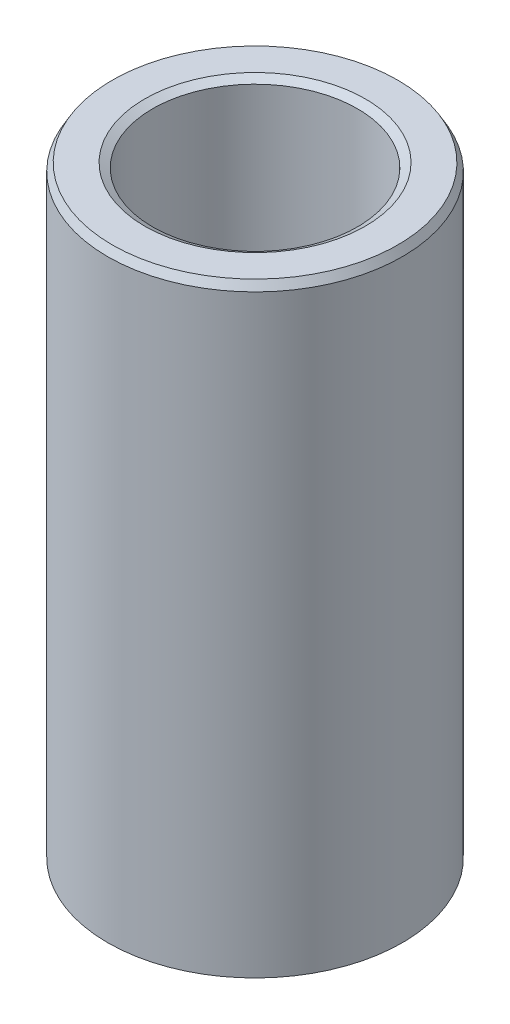
ISO-10303-21;
HEADER;
FILE_DESCRIPTION(('STEP AP214'),'2;1');
FILE_NAME('part.step','',(''),(''),'','','');
FILE_SCHEMA(('AUTOMOTIVE_DESIGN { 1 0 10303 214 1 1 1 1 }'));
ENDSEC;
DATA;
#1=APPLICATION_CONTEXT('core data for automotive mechanical design processes');
#2=APPLICATION_PROTOCOL_DEFINITION('international standard','automotive_design',2000,#1);
#3=PRODUCT_CONTEXT('',#1,'mechanical');
#4=PRODUCT('Part','Part','',(#3));
#5=PRODUCT_RELATED_PRODUCT_CATEGORY('part','',(#4));
#6=PRODUCT_DEFINITION_FORMATION('','',#4);
#7=PRODUCT_DEFINITION_CONTEXT('part definition',#1,'design');
#8=PRODUCT_DEFINITION('design','',#6,#7);
#9=PRODUCT_DEFINITION_SHAPE('','',#8);
#10=(LENGTH_UNIT() NAMED_UNIT(*) SI_UNIT(.MILLI.,.METRE.));
#11=(NAMED_UNIT(*) PLANE_ANGLE_UNIT() SI_UNIT($,.RADIAN.));
#12=(NAMED_UNIT(*) SI_UNIT($,.STERADIAN.) SOLID_ANGLE_UNIT());
#13=UNCERTAINTY_MEASURE_WITH_UNIT(LENGTH_MEASURE(1.E-05),#10,'distance_accuracy_value','');
#14=(GEOMETRIC_REPRESENTATION_CONTEXT(3) GLOBAL_UNCERTAINTY_ASSIGNED_CONTEXT((#13)) GLOBAL_UNIT_ASSIGNED_CONTEXT((#10,
#11,#12)) REPRESENTATION_CONTEXT('',''));
#15=CARTESIAN_POINT('',(0.,0.,0.));
#16=DIRECTION('',(0.,0.,1.));
#17=DIRECTION('',(1.,0.,0.));
#18=AXIS2_PLACEMENT_3D('',#15,#16,#17);
#19=CARTESIAN_POINT('',(0.,164.704261430493,0.));
#20=DIRECTION('',(0.,-1.,0.));
#21=DIRECTION('',(0.,0.,-1.));
#22=AXIS2_PLACEMENT_3D('',#19,#20,#21);
#23=CYLINDRICAL_SURFACE('',#22,40.);
#24=CARTESIAN_POINT('',(0.,1.23833515789418,0.));
#25=DIRECTION('',(0.,1.,0.));
#26=DIRECTION('',(0.,0.,1.));
#27=AXIS2_PLACEMENT_3D('',#24,#25,#26);
#28=CIRCLE('',#27,40.);
#29=CARTESIAN_POINT('',(0.,1.23833515789418,40.));
#30=VERTEX_POINT('',#29);
#31=EDGE_CURVE('E10',#30,#30,#28,.T.);
#32=ORIENTED_EDGE('',*,*,#31,.T.);
#33=EDGE_LOOP('',(#32));
#34=FACE_BOUND('',#33,.T.);
#35=CARTESIAN_POINT('',(0.,162.559402020222,0.));
#36=DIRECTION('',(0.,1.,0.));
#37=DIRECTION('',(0.,0.,1.));
#38=AXIS2_PLACEMENT_3D('',#35,#36,#37);
#39=CIRCLE('',#38,40.);
#40=CARTESIAN_POINT('',(0.,162.559402020222,40.));
#41=VERTEX_POINT('',#40);
#42=EDGE_CURVE('E50',#41,#41,#39,.F.);
#43=ORIENTED_EDGE('',*,*,#42,.T.);
#44=EDGE_LOOP('',(#43));
#45=FACE_BOUND('',#44,.T.);
#46=ADVANCED_FACE('F39',(#34,#45),#23,.T.);
#47=CARTESIAN_POINT('',(0.,164.704261430493,0.));
#48=DIRECTION('',(0.,1.,0.));
#49=DIRECTION('',(0.,0.,1.));
#50=AXIS2_PLACEMENT_3D('',#47,#48,#49);
#51=PLANE('',#50);
#52=CARTESIAN_POINT('',(0.,164.704261430493,0.));
#53=DIRECTION('',(0.,1.,0.));
#54=DIRECTION('',(0.,0.,1.));
#55=AXIS2_PLACEMENT_3D('',#52,#53,#54);
#56=CIRCLE('',#55,29.9552476298192);
#57=CARTESIAN_POINT('',(0.,164.704261430493,29.9552476298192));
#58=VERTEX_POINT('',#57);
#59=EDGE_CURVE('E58',#58,#58,#56,.F.);
#60=ORIENTED_EDGE('',*,*,#59,.T.);
#61=EDGE_LOOP('',(#60));
#62=FACE_BOUND('',#61,.T.);
#63=CARTESIAN_POINT('',(0.,164.704261430493,0.));
#64=DIRECTION('',(0.,1.,0.));
#65=DIRECTION('',(0.,0.,1.));
#66=AXIS2_PLACEMENT_3D('',#63,#64,#65);
#67=CIRCLE('',#66,38.7616648421058);
#68=CARTESIAN_POINT('',(0.,164.704261430493,38.7616648421058));
#69=VERTEX_POINT('',#68);
#70=EDGE_CURVE('E61',#69,#69,#67,.T.);
#71=ORIENTED_EDGE('',*,*,#70,.T.);
#72=EDGE_LOOP('',(#71));
#73=FACE_BOUND('',#72,.T.);
#74=ADVANCED_FACE('F88',(#62,#73),#51,.T.);
#75=CARTESIAN_POINT('',(0.,0.,0.));
#76=DIRECTION('',(0.,1.,0.));
#77=DIRECTION('',(0.,0.,1.));
#78=AXIS2_PLACEMENT_3D('',#75,#76,#77);
#79=PLANE('',#78);
#80=CARTESIAN_POINT('',(0.,0.,0.));
#81=DIRECTION('',(0.,1.,0.));
#82=DIRECTION('',(0.,0.,1.));
#83=AXIS2_PLACEMENT_3D('',#80,#81,#82);
#84=CIRCLE('',#83,29.0487233774418);
#85=CARTESIAN_POINT('',(0.,0.,29.0487233774418));
#86=VERTEX_POINT('',#85);
#87=EDGE_CURVE('E51',#86,#86,#84,.T.);
#88=ORIENTED_EDGE('',*,*,#87,.T.);
#89=EDGE_LOOP('',(#88));
#90=FACE_BOUND('',#89,.T.);
#91=CARTESIAN_POINT('',(0.,0.,0.));
#92=DIRECTION('',(0.,1.,0.));
#93=DIRECTION('',(0.,0.,1.));
#94=AXIS2_PLACEMENT_3D('',#91,#92,#93);
#95=CIRCLE('',#94,37.8551405897284);
#96=CARTESIAN_POINT('',(0.,0.,37.8551405897284));
#97=VERTEX_POINT('',#96);
#98=EDGE_CURVE('E54',#97,#97,#95,.F.);
#99=ORIENTED_EDGE('',*,*,#98,.T.);
#100=EDGE_LOOP('',(#99));
#101=FACE_BOUND('',#100,.T.);
#102=ADVANCED_FACE('F83',(#90,#101),#79,.F.);
#103=CARTESIAN_POINT('',(0.,164.704261430493,0.));
#104=DIRECTION('',(0.,-1.,0.));
#105=DIRECTION('',(0.,0.,-1.));
#106=AXIS2_PLACEMENT_3D('',#103,#104,#105);
#107=CYLINDRICAL_SURFACE('',#106,27.8103882195477);
#108=CARTESIAN_POINT('',(0.,163.465926272599,0.));
#109=DIRECTION('',(0.,1.,0.));
#110=DIRECTION('',(0.,0.,1.));
#111=AXIS2_PLACEMENT_3D('',#108,#109,#110);
#112=CIRCLE('',#111,27.8103882195477);
#113=CARTESIAN_POINT('',(0.,163.465926272599,27.8103882195477));
#114=VERTEX_POINT('',#113);
#115=EDGE_CURVE('E67',#114,#114,#112,.T.);
#116=ORIENTED_EDGE('',*,*,#115,.T.);
#117=EDGE_LOOP('',(#116));
#118=FACE_BOUND('',#117,.T.);
#119=CARTESIAN_POINT('',(0.,2.14485941027154,0.));
#120=DIRECTION('',(0.,1.,0.));
#121=DIRECTION('',(0.,0.,1.));
#122=AXIS2_PLACEMENT_3D('',#119,#120,#121);
#123=CIRCLE('',#122,27.8103882195477);
#124=CARTESIAN_POINT('',(0.,2.14485941027154,27.8103882195477));
#125=VERTEX_POINT('',#124);
#126=EDGE_CURVE('E69',#125,#125,#123,.F.);
#127=ORIENTED_EDGE('',*,*,#126,.T.);
#128=EDGE_LOOP('',(#127));
#129=FACE_BOUND('',#128,.T.);
#130=ADVANCED_FACE('F71',(#118,#129),#107,.F.);
#131=CARTESIAN_POINT('',(0.,163.465926272599,0.));
#132=DIRECTION('',(0.,1.,0.));
#133=DIRECTION('',(0.,0.,1.));
#134=AXIS2_PLACEMENT_3D('',#131,#132,#133);
#135=CONICAL_SURFACE('',#134,27.8103882195477,1.04719755119659);
#136=ORIENTED_EDGE('',*,*,#59,.F.);
#137=EDGE_LOOP('',(#136));
#138=FACE_BOUND('',#137,.T.);
#139=ORIENTED_EDGE('',*,*,#115,.F.);
#140=EDGE_LOOP('',(#139));
#141=FACE_BOUND('',#140,.T.);
#142=ADVANCED_FACE('F77',(#138,#141),#135,.F.);
#143=CARTESIAN_POINT('',(0.,0.,0.));
#144=DIRECTION('',(0.,-1.,0.));
#145=DIRECTION('',(0.,0.,-1.));
#146=AXIS2_PLACEMENT_3D('',#143,#144,#145);
#147=CONICAL_SURFACE('',#146,29.0487233774418,0.523598775598289);
#148=ORIENTED_EDGE('',*,*,#126,.F.);
#149=EDGE_LOOP('',(#148));
#150=FACE_BOUND('',#149,.T.);
#151=ORIENTED_EDGE('',*,*,#87,.F.);
#152=EDGE_LOOP('',(#151));
#153=FACE_BOUND('',#152,.T.);
#154=ADVANCED_FACE('F73',(#150,#153),#147,.F.);
#155=CARTESIAN_POINT('',(0.,1.23833515789418,0.));
#156=DIRECTION('',(0.,1.,0.));
#157=DIRECTION('',(0.,0.,1.));
#158=AXIS2_PLACEMENT_3D('',#155,#156,#157);
#159=CONICAL_SURFACE('',#158,40.,1.0471975511966);
#160=ORIENTED_EDGE('',*,*,#98,.F.);
#161=EDGE_LOOP('',(#160));
#162=FACE_BOUND('',#161,.T.);
#163=ORIENTED_EDGE('',*,*,#31,.F.);
#164=EDGE_LOOP('',(#163));
#165=FACE_BOUND('',#164,.T.);
#166=ADVANCED_FACE('F76',(#162,#165),#159,.T.);
#167=CARTESIAN_POINT('',(0.,164.704261430493,0.));
#168=DIRECTION('',(0.,-1.,0.));
#169=DIRECTION('',(0.,0.,-1.));
#170=AXIS2_PLACEMENT_3D('',#167,#168,#169);
#171=CONICAL_SURFACE('',#170,38.7616648421058,0.523598775598292);
#172=ORIENTED_EDGE('',*,*,#42,.F.);
#173=EDGE_LOOP('',(#172));
#174=FACE_BOUND('',#173,.T.);
#175=ORIENTED_EDGE('',*,*,#70,.F.);
#176=EDGE_LOOP('',(#175));
#177=FACE_BOUND('',#176,.T.);
#178=ADVANCED_FACE('F45',(#174,#177),#171,.T.);
#179=CLOSED_SHELL('',(#46,#74,#102,#130,#142,#154,#166,#178));
#180=MANIFOLD_SOLID_BREP('B2',#179);
#181=ADVANCED_BREP_SHAPE_REPRESENTATION('',(#18,#180),#14);
#182=SHAPE_DEFINITION_REPRESENTATION(#9,#181);
ENDSEC;
END-ISO-10303-21;
